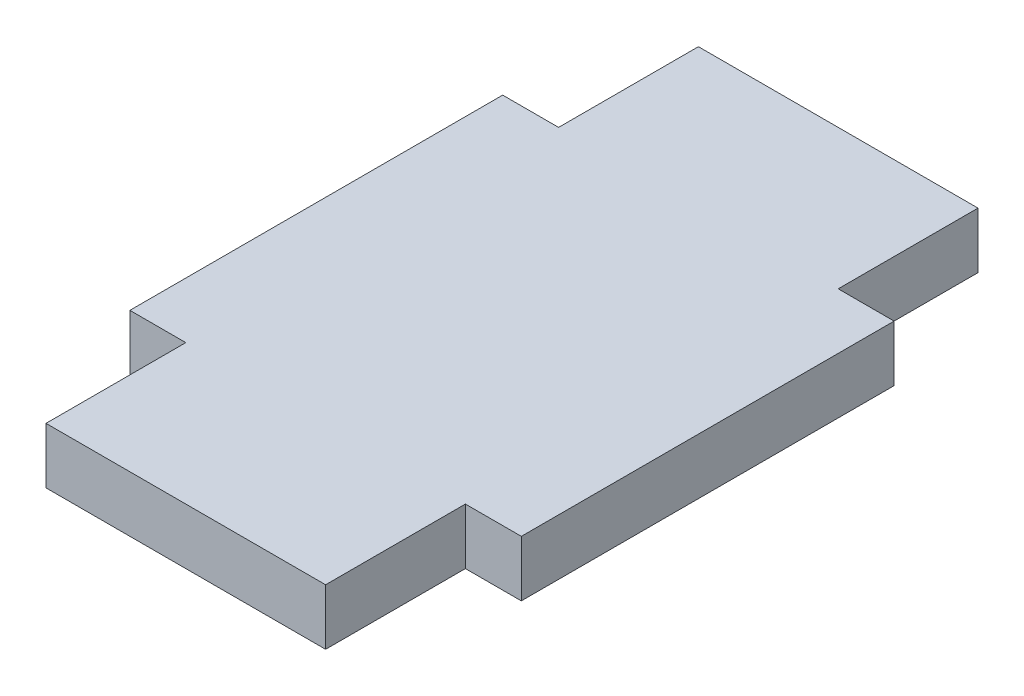
ISO-10303-21;
HEADER;
FILE_DESCRIPTION(('STEP AP214'),'2;1');
FILE_NAME('part.step','',(''),(''),'','','');
FILE_SCHEMA(('AUTOMOTIVE_DESIGN { 1 0 10303 214 1 1 1 1 }'));
ENDSEC;
DATA;
#1=APPLICATION_CONTEXT('core data for automotive mechanical design processes');
#2=APPLICATION_PROTOCOL_DEFINITION('international standard','automotive_design',2000,#1);
#3=PRODUCT_CONTEXT('',#1,'mechanical');
#4=PRODUCT('Part','Part','',(#3));
#5=PRODUCT_RELATED_PRODUCT_CATEGORY('part','',(#4));
#6=PRODUCT_DEFINITION_FORMATION('','',#4);
#7=PRODUCT_DEFINITION_CONTEXT('part definition',#1,'design');
#8=PRODUCT_DEFINITION('design','',#6,#7);
#9=PRODUCT_DEFINITION_SHAPE('','',#8);
#10=(LENGTH_UNIT() NAMED_UNIT(*) SI_UNIT(.MILLI.,.METRE.));
#11=(NAMED_UNIT(*) PLANE_ANGLE_UNIT() SI_UNIT($,.RADIAN.));
#12=(NAMED_UNIT(*) SI_UNIT($,.STERADIAN.) SOLID_ANGLE_UNIT());
#13=UNCERTAINTY_MEASURE_WITH_UNIT(LENGTH_MEASURE(1.E-05),#10,'distance_accuracy_value','');
#14=(GEOMETRIC_REPRESENTATION_CONTEXT(3) GLOBAL_UNCERTAINTY_ASSIGNED_CONTEXT((#13)) GLOBAL_UNIT_ASSIGNED_CONTEXT((#10,
#11,#12)) REPRESENTATION_CONTEXT('',''));
#15=CARTESIAN_POINT('',(0.,0.,0.));
#16=DIRECTION('',(0.,0.,1.));
#17=DIRECTION('',(1.,0.,0.));
#18=AXIS2_PLACEMENT_3D('',#15,#16,#17);
#19=CARTESIAN_POINT('',(-10.5,1.5,10.));
#20=DIRECTION('',(1.,0.,0.));
#21=DIRECTION('',(0.,0.,-1.));
#22=AXIS2_PLACEMENT_3D('',#19,#20,#21);
#23=PLANE('',#22);
#24=DIRECTION('',(0.,0.,1.));
#25=VECTOR('',#24,1.);
#26=CARTESIAN_POINT('',(-10.5,-1.5,10.));
#27=LINE('',#26,#25);
#28=CARTESIAN_POINT('',(-10.5,-1.5,-10.));
#29=VERTEX_POINT('',#28);
#30=CARTESIAN_POINT('',(-10.5,-1.5,10.));
#31=VERTEX_POINT('',#30);
#32=EDGE_CURVE('E159',#29,#31,#27,.T.);
#33=ORIENTED_EDGE('',*,*,#32,.T.);
#34=DIRECTION('',(0.,-1.,0.));
#35=VECTOR('',#34,1.);
#36=CARTESIAN_POINT('',(-10.5,1.5,10.));
#37=LINE('',#36,#35);
#38=CARTESIAN_POINT('',(-10.5,1.5,10.));
#39=VERTEX_POINT('',#38);
#40=EDGE_CURVE('E11',#39,#31,#37,.T.);
#41=ORIENTED_EDGE('',*,*,#40,.F.);
#42=DIRECTION('',(0.,0.,1.));
#43=VECTOR('',#42,1.);
#44=CARTESIAN_POINT('',(-10.5,1.5,10.));
#45=LINE('',#44,#43);
#46=CARTESIAN_POINT('',(-10.5,1.5,-10.));
#47=VERTEX_POINT('',#46);
#48=EDGE_CURVE('E181',#47,#39,#45,.T.);
#49=ORIENTED_EDGE('',*,*,#48,.F.);
#50=DIRECTION('',(0.,-1.,0.));
#51=VECTOR('',#50,1.);
#52=CARTESIAN_POINT('',(-10.5,1.5,-10.));
#53=LINE('',#52,#51);
#54=EDGE_CURVE('E155',#47,#29,#53,.T.);
#55=ORIENTED_EDGE('',*,*,#54,.T.);
#56=EDGE_LOOP('',(#33,#41,#49,#55));
#57=FACE_BOUND('',#56,.T.);
#58=ADVANCED_FACE('F39',(#57),#23,.F.);
#59=CARTESIAN_POINT('',(-7.5,1.5,10.));
#60=DIRECTION('',(0.,0.,-1.));
#61=DIRECTION('',(-1.,0.,0.));
#62=AXIS2_PLACEMENT_3D('',#59,#60,#61);
#63=PLANE('',#62);
#64=DIRECTION('',(1.,0.,0.));
#65=VECTOR('',#64,1.);
#66=CARTESIAN_POINT('',(-7.5,-1.5,10.));
#67=LINE('',#66,#65);
#68=CARTESIAN_POINT('',(-7.5,-1.5,10.));
#69=VERTEX_POINT('',#68);
#70=EDGE_CURVE('E162',#31,#69,#67,.T.);
#71=ORIENTED_EDGE('',*,*,#70,.T.);
#72=DIRECTION('',(0.,-1.,0.));
#73=VECTOR('',#72,1.);
#74=CARTESIAN_POINT('',(-7.5,1.5,10.));
#75=LINE('',#74,#73);
#76=CARTESIAN_POINT('',(-7.5,1.5,10.));
#77=VERTEX_POINT('',#76);
#78=EDGE_CURVE('E47',#77,#69,#75,.T.);
#79=ORIENTED_EDGE('',*,*,#78,.F.);
#80=DIRECTION('',(1.,0.,0.));
#81=VECTOR('',#80,1.);
#82=CARTESIAN_POINT('',(-7.5,1.5,10.));
#83=LINE('',#82,#81);
#84=EDGE_CURVE('E110',#39,#77,#83,.T.);
#85=ORIENTED_EDGE('',*,*,#84,.F.);
#86=ORIENTED_EDGE('',*,*,#40,.T.);
#87=EDGE_LOOP('',(#71,#79,#85,#86));
#88=FACE_BOUND('',#87,.T.);
#89=ADVANCED_FACE('F259',(#88),#63,.F.);
#90=CARTESIAN_POINT('',(-7.5,1.5,17.5));
#91=DIRECTION('',(1.,0.,0.));
#92=DIRECTION('',(0.,0.,-1.));
#93=AXIS2_PLACEMENT_3D('',#90,#91,#92);
#94=PLANE('',#93);
#95=DIRECTION('',(0.,0.,1.));
#96=VECTOR('',#95,1.);
#97=CARTESIAN_POINT('',(-7.5,-1.5,17.5));
#98=LINE('',#97,#96);
#99=CARTESIAN_POINT('',(-7.5,-1.5,17.5));
#100=VERTEX_POINT('',#99);
#101=EDGE_CURVE('E164',#69,#100,#98,.T.);
#102=ORIENTED_EDGE('',*,*,#101,.T.);
#103=DIRECTION('',(0.,-1.,0.));
#104=VECTOR('',#103,1.);
#105=CARTESIAN_POINT('',(-7.5,1.5,17.5));
#106=LINE('',#105,#104);
#107=CARTESIAN_POINT('',(-7.5,1.5,17.5));
#108=VERTEX_POINT('',#107);
#109=EDGE_CURVE('E200',#108,#100,#106,.T.);
#110=ORIENTED_EDGE('',*,*,#109,.F.);
#111=DIRECTION('',(0.,0.,1.));
#112=VECTOR('',#111,1.);
#113=CARTESIAN_POINT('',(-7.5,1.5,17.5));
#114=LINE('',#113,#112);
#115=EDGE_CURVE('E208',#77,#108,#114,.T.);
#116=ORIENTED_EDGE('',*,*,#115,.F.);
#117=ORIENTED_EDGE('',*,*,#78,.T.);
#118=EDGE_LOOP('',(#102,#110,#116,#117));
#119=FACE_BOUND('',#118,.T.);
#120=ADVANCED_FACE('F206',(#119),#94,.F.);
#121=CARTESIAN_POINT('',(7.5,1.5,17.5));
#122=DIRECTION('',(0.,0.,-1.));
#123=DIRECTION('',(-1.,0.,0.));
#124=AXIS2_PLACEMENT_3D('',#121,#122,#123);
#125=PLANE('',#124);
#126=DIRECTION('',(1.,0.,0.));
#127=VECTOR('',#126,1.);
#128=CARTESIAN_POINT('',(7.5,-1.5,17.5));
#129=LINE('',#128,#127);
#130=CARTESIAN_POINT('',(7.5,-1.5,17.5));
#131=VERTEX_POINT('',#130);
#132=EDGE_CURVE('E166',#100,#131,#129,.T.);
#133=ORIENTED_EDGE('',*,*,#132,.T.);
#134=DIRECTION('',(0.,-1.,0.));
#135=VECTOR('',#134,1.);
#136=CARTESIAN_POINT('',(7.5,1.5,17.5));
#137=LINE('',#136,#135);
#138=CARTESIAN_POINT('',(7.5,1.5,17.5));
#139=VERTEX_POINT('',#138);
#140=EDGE_CURVE('E197',#139,#131,#137,.T.);
#141=ORIENTED_EDGE('',*,*,#140,.F.);
#142=DIRECTION('',(1.,0.,0.));
#143=VECTOR('',#142,1.);
#144=CARTESIAN_POINT('',(7.5,1.5,17.5));
#145=LINE('',#144,#143);
#146=EDGE_CURVE('E226',#108,#139,#145,.T.);
#147=ORIENTED_EDGE('',*,*,#146,.F.);
#148=ORIENTED_EDGE('',*,*,#109,.T.);
#149=EDGE_LOOP('',(#133,#141,#147,#148));
#150=FACE_BOUND('',#149,.T.);
#151=ADVANCED_FACE('F217',(#150),#125,.F.);
#152=CARTESIAN_POINT('',(7.5,1.5,10.));
#153=DIRECTION('',(-1.,0.,0.));
#154=DIRECTION('',(0.,0.,1.));
#155=AXIS2_PLACEMENT_3D('',#152,#153,#154);
#156=PLANE('',#155);
#157=DIRECTION('',(0.,0.,-1.));
#158=VECTOR('',#157,1.);
#159=CARTESIAN_POINT('',(7.5,-1.5,10.));
#160=LINE('',#159,#158);
#161=CARTESIAN_POINT('',(7.5,-1.5,10.));
#162=VERTEX_POINT('',#161);
#163=EDGE_CURVE('E168',#131,#162,#160,.T.);
#164=ORIENTED_EDGE('',*,*,#163,.T.);
#165=DIRECTION('',(0.,-1.,0.));
#166=VECTOR('',#165,1.);
#167=CARTESIAN_POINT('',(7.5,1.5,10.));
#168=LINE('',#167,#166);
#169=CARTESIAN_POINT('',(7.5,1.5,10.));
#170=VERTEX_POINT('',#169);
#171=EDGE_CURVE('E194',#170,#162,#168,.T.);
#172=ORIENTED_EDGE('',*,*,#171,.F.);
#173=DIRECTION('',(0.,0.,-1.));
#174=VECTOR('',#173,1.);
#175=CARTESIAN_POINT('',(7.5,1.5,10.));
#176=LINE('',#175,#174);
#177=EDGE_CURVE('E223',#139,#170,#176,.T.);
#178=ORIENTED_EDGE('',*,*,#177,.F.);
#179=ORIENTED_EDGE('',*,*,#140,.T.);
#180=EDGE_LOOP('',(#164,#172,#178,#179));
#181=FACE_BOUND('',#180,.T.);
#182=ADVANCED_FACE('F221',(#181),#156,.F.);
#183=CARTESIAN_POINT('',(10.5,1.5,10.));
#184=DIRECTION('',(0.,0.,-1.));
#185=DIRECTION('',(-1.,0.,0.));
#186=AXIS2_PLACEMENT_3D('',#183,#184,#185);
#187=PLANE('',#186);
#188=DIRECTION('',(1.,0.,0.));
#189=VECTOR('',#188,1.);
#190=CARTESIAN_POINT('',(10.5,-1.5,10.));
#191=LINE('',#190,#189);
#192=CARTESIAN_POINT('',(10.5,-1.5,10.));
#193=VERTEX_POINT('',#192);
#194=EDGE_CURVE('E170',#162,#193,#191,.T.);
#195=ORIENTED_EDGE('',*,*,#194,.T.);
#196=DIRECTION('',(0.,-1.,0.));
#197=VECTOR('',#196,1.);
#198=CARTESIAN_POINT('',(10.5,1.5,10.));
#199=LINE('',#198,#197);
#200=CARTESIAN_POINT('',(10.5,1.5,10.));
#201=VERTEX_POINT('',#200);
#202=EDGE_CURVE('E191',#201,#193,#199,.T.);
#203=ORIENTED_EDGE('',*,*,#202,.F.);
#204=DIRECTION('',(1.,0.,0.));
#205=VECTOR('',#204,1.);
#206=CARTESIAN_POINT('',(10.5,1.5,10.));
#207=LINE('',#206,#205);
#208=EDGE_CURVE('E225',#170,#201,#207,.T.);
#209=ORIENTED_EDGE('',*,*,#208,.F.);
#210=ORIENTED_EDGE('',*,*,#171,.T.);
#211=EDGE_LOOP('',(#195,#203,#209,#210));
#212=FACE_BOUND('',#211,.T.);
#213=ADVANCED_FACE('F272',(#212),#187,.F.);
#214=CARTESIAN_POINT('',(10.5,1.5,-10.));
#215=DIRECTION('',(-1.,0.,0.));
#216=DIRECTION('',(0.,0.,1.));
#217=AXIS2_PLACEMENT_3D('',#214,#215,#216);
#218=PLANE('',#217);
#219=DIRECTION('',(0.,0.,-1.));
#220=VECTOR('',#219,1.);
#221=CARTESIAN_POINT('',(10.5,-1.5,-10.));
#222=LINE('',#221,#220);
#223=CARTESIAN_POINT('',(10.5,-1.5,-10.));
#224=VERTEX_POINT('',#223);
#225=EDGE_CURVE('E172',#193,#224,#222,.T.);
#226=ORIENTED_EDGE('',*,*,#225,.T.);
#227=DIRECTION('',(0.,-1.,0.));
#228=VECTOR('',#227,1.);
#229=CARTESIAN_POINT('',(10.5,1.5,-10.));
#230=LINE('',#229,#228);
#231=CARTESIAN_POINT('',(10.5,1.5,-10.));
#232=VERTEX_POINT('',#231);
#233=EDGE_CURVE('E188',#232,#224,#230,.T.);
#234=ORIENTED_EDGE('',*,*,#233,.F.);
#235=DIRECTION('',(0.,0.,-1.));
#236=VECTOR('',#235,1.);
#237=CARTESIAN_POINT('',(10.5,1.5,-10.));
#238=LINE('',#237,#236);
#239=EDGE_CURVE('E228',#201,#232,#238,.T.);
#240=ORIENTED_EDGE('',*,*,#239,.F.);
#241=ORIENTED_EDGE('',*,*,#202,.T.);
#242=EDGE_LOOP('',(#226,#234,#240,#241));
#243=FACE_BOUND('',#242,.T.);
#244=ADVANCED_FACE('F275',(#243),#218,.F.);
#245=CARTESIAN_POINT('',(7.5,1.5,-10.));
#246=DIRECTION('',(0.,0.,1.));
#247=DIRECTION('',(1.,0.,0.));
#248=AXIS2_PLACEMENT_3D('',#245,#246,#247);
#249=PLANE('',#248);
#250=DIRECTION('',(-1.,0.,0.));
#251=VECTOR('',#250,1.);
#252=CARTESIAN_POINT('',(7.5,-1.5,-10.));
#253=LINE('',#252,#251);
#254=CARTESIAN_POINT('',(7.5,-1.5,-10.));
#255=VERTEX_POINT('',#254);
#256=EDGE_CURVE('E174',#224,#255,#253,.T.);
#257=ORIENTED_EDGE('',*,*,#256,.T.);
#258=DIRECTION('',(0.,-1.,0.));
#259=VECTOR('',#258,1.);
#260=CARTESIAN_POINT('',(7.5,1.5,-10.));
#261=LINE('',#260,#259);
#262=CARTESIAN_POINT('',(7.5,1.5,-10.));
#263=VERTEX_POINT('',#262);
#264=EDGE_CURVE('E185',#263,#255,#261,.T.);
#265=ORIENTED_EDGE('',*,*,#264,.F.);
#266=DIRECTION('',(-1.,0.,0.));
#267=VECTOR('',#266,1.);
#268=CARTESIAN_POINT('',(7.5,1.5,-10.));
#269=LINE('',#268,#267);
#270=EDGE_CURVE('E234',#232,#263,#269,.T.);
#271=ORIENTED_EDGE('',*,*,#270,.F.);
#272=ORIENTED_EDGE('',*,*,#233,.T.);
#273=EDGE_LOOP('',(#257,#265,#271,#272));
#274=FACE_BOUND('',#273,.T.);
#275=ADVANCED_FACE('F240',(#274),#249,.F.);
#276=CARTESIAN_POINT('',(7.5,1.5,-17.5));
#277=DIRECTION('',(-1.,0.,0.));
#278=DIRECTION('',(0.,0.,1.));
#279=AXIS2_PLACEMENT_3D('',#276,#277,#278);
#280=PLANE('',#279);
#281=DIRECTION('',(0.,0.,-1.));
#282=VECTOR('',#281,1.);
#283=CARTESIAN_POINT('',(7.5,-1.5,-17.5));
#284=LINE('',#283,#282);
#285=CARTESIAN_POINT('',(7.5,-1.5,-17.5));
#286=VERTEX_POINT('',#285);
#287=EDGE_CURVE('E176',#255,#286,#284,.T.);
#288=ORIENTED_EDGE('',*,*,#287,.T.);
#289=DIRECTION('',(0.,-1.,0.));
#290=VECTOR('',#289,1.);
#291=CARTESIAN_POINT('',(7.5,1.5,-17.5));
#292=LINE('',#291,#290);
#293=CARTESIAN_POINT('',(7.5,1.5,-17.5));
#294=VERTEX_POINT('',#293);
#295=EDGE_CURVE('E150',#294,#286,#292,.T.);
#296=ORIENTED_EDGE('',*,*,#295,.F.);
#297=DIRECTION('',(0.,0.,-1.));
#298=VECTOR('',#297,1.);
#299=CARTESIAN_POINT('',(7.5,1.5,-17.5));
#300=LINE('',#299,#298);
#301=EDGE_CURVE('E141',#263,#294,#300,.T.);
#302=ORIENTED_EDGE('',*,*,#301,.F.);
#303=ORIENTED_EDGE('',*,*,#264,.T.);
#304=EDGE_LOOP('',(#288,#296,#302,#303));
#305=FACE_BOUND('',#304,.T.);
#306=ADVANCED_FACE('F244',(#305),#280,.F.);
#307=CARTESIAN_POINT('',(-7.5,1.5,-17.5));
#308=DIRECTION('',(0.,0.,1.));
#309=DIRECTION('',(1.,0.,0.));
#310=AXIS2_PLACEMENT_3D('',#307,#308,#309);
#311=PLANE('',#310);
#312=DIRECTION('',(-1.,0.,0.));
#313=VECTOR('',#312,1.);
#314=CARTESIAN_POINT('',(-7.5,-1.5,-17.5));
#315=LINE('',#314,#313);
#316=CARTESIAN_POINT('',(-7.5,-1.5,-17.5));
#317=VERTEX_POINT('',#316);
#318=EDGE_CURVE('E149',#286,#317,#315,.T.);
#319=ORIENTED_EDGE('',*,*,#318,.T.);
#320=DIRECTION('',(0.,-1.,0.));
#321=VECTOR('',#320,1.);
#322=CARTESIAN_POINT('',(-7.5,1.5,-17.5));
#323=LINE('',#322,#321);
#324=CARTESIAN_POINT('',(-7.5,1.5,-17.5));
#325=VERTEX_POINT('',#324);
#326=EDGE_CURVE('E146',#325,#317,#323,.T.);
#327=ORIENTED_EDGE('',*,*,#326,.F.);
#328=DIRECTION('',(-1.,0.,0.));
#329=VECTOR('',#328,1.);
#330=CARTESIAN_POINT('',(-7.5,1.5,-17.5));
#331=LINE('',#330,#329);
#332=EDGE_CURVE('E135',#294,#325,#331,.T.);
#333=ORIENTED_EDGE('',*,*,#332,.F.);
#334=ORIENTED_EDGE('',*,*,#295,.T.);
#335=EDGE_LOOP('',(#319,#327,#333,#334));
#336=FACE_BOUND('',#335,.T.);
#337=ADVANCED_FACE('F147',(#336),#311,.F.);
#338=CARTESIAN_POINT('',(-7.5,1.5,-10.));
#339=DIRECTION('',(1.,0.,0.));
#340=DIRECTION('',(0.,0.,-1.));
#341=AXIS2_PLACEMENT_3D('',#338,#339,#340);
#342=PLANE('',#341);
#343=DIRECTION('',(0.,0.,1.));
#344=VECTOR('',#343,1.);
#345=CARTESIAN_POINT('',(-7.5,-1.5,-10.));
#346=LINE('',#345,#344);
#347=CARTESIAN_POINT('',(-7.5,-1.5,-10.));
#348=VERTEX_POINT('',#347);
#349=EDGE_CURVE('E96',#317,#348,#346,.T.);
#350=ORIENTED_EDGE('',*,*,#349,.T.);
#351=DIRECTION('',(0.,-1.,0.));
#352=VECTOR('',#351,1.);
#353=CARTESIAN_POINT('',(-7.5,1.5,-10.));
#354=LINE('',#353,#352);
#355=CARTESIAN_POINT('',(-7.5,1.5,-10.));
#356=VERTEX_POINT('',#355);
#357=EDGE_CURVE('E151',#356,#348,#354,.T.);
#358=ORIENTED_EDGE('',*,*,#357,.F.);
#359=DIRECTION('',(0.,0.,1.));
#360=VECTOR('',#359,1.);
#361=CARTESIAN_POINT('',(-7.5,1.5,-10.));
#362=LINE('',#361,#360);
#363=EDGE_CURVE('E139',#325,#356,#362,.T.);
#364=ORIENTED_EDGE('',*,*,#363,.F.);
#365=ORIENTED_EDGE('',*,*,#326,.T.);
#366=EDGE_LOOP('',(#350,#358,#364,#365));
#367=FACE_BOUND('',#366,.T.);
#368=ADVANCED_FACE('F153',(#367),#342,.F.);
#369=CARTESIAN_POINT('',(-10.5,1.5,-10.));
#370=DIRECTION('',(0.,0.,1.));
#371=DIRECTION('',(1.,0.,0.));
#372=AXIS2_PLACEMENT_3D('',#369,#370,#371);
#373=PLANE('',#372);
#374=DIRECTION('',(-1.,0.,0.));
#375=VECTOR('',#374,1.);
#376=CARTESIAN_POINT('',(-10.5,-1.5,-10.));
#377=LINE('',#376,#375);
#378=EDGE_CURVE('E102',#348,#29,#377,.T.);
#379=ORIENTED_EDGE('',*,*,#378,.T.);
#380=ORIENTED_EDGE('',*,*,#54,.F.);
#381=DIRECTION('',(-1.,0.,0.));
#382=VECTOR('',#381,1.);
#383=CARTESIAN_POINT('',(-10.5,1.5,-10.));
#384=LINE('',#383,#382);
#385=EDGE_CURVE('E55',#356,#47,#384,.T.);
#386=ORIENTED_EDGE('',*,*,#385,.F.);
#387=ORIENTED_EDGE('',*,*,#357,.T.);
#388=EDGE_LOOP('',(#379,#380,#386,#387));
#389=FACE_BOUND('',#388,.T.);
#390=ADVANCED_FACE('F248',(#389),#373,.F.);
#391=CARTESIAN_POINT('',(0.,1.5,0.));
#392=DIRECTION('',(0.,-1.,0.));
#393=DIRECTION('',(0.,0.,-1.));
#394=AXIS2_PLACEMENT_3D('',#391,#392,#393);
#395=PLANE('',#394);
#396=ORIENTED_EDGE('',*,*,#48,.T.);
#397=ORIENTED_EDGE('',*,*,#84,.T.);
#398=ORIENTED_EDGE('',*,*,#115,.T.);
#399=ORIENTED_EDGE('',*,*,#146,.T.);
#400=ORIENTED_EDGE('',*,*,#177,.T.);
#401=ORIENTED_EDGE('',*,*,#208,.T.);
#402=ORIENTED_EDGE('',*,*,#239,.T.);
#403=ORIENTED_EDGE('',*,*,#270,.T.);
#404=ORIENTED_EDGE('',*,*,#301,.T.);
#405=ORIENTED_EDGE('',*,*,#332,.T.);
#406=ORIENTED_EDGE('',*,*,#363,.T.);
#407=ORIENTED_EDGE('',*,*,#385,.T.);
#408=EDGE_LOOP('',(#396,#397,#398,#399,#400,#401,#402,#403,#404,#405,#406,#407));
#409=FACE_BOUND('',#408,.T.);
#410=ADVANCED_FACE('F137',(#409),#395,.F.);
#411=CARTESIAN_POINT('',(0.,-1.5,0.));
#412=DIRECTION('',(0.,-1.,0.));
#413=DIRECTION('',(0.,0.,-1.));
#414=AXIS2_PLACEMENT_3D('',#411,#412,#413);
#415=PLANE('',#414);
#416=ORIENTED_EDGE('',*,*,#32,.F.);
#417=ORIENTED_EDGE('',*,*,#378,.F.);
#418=ORIENTED_EDGE('',*,*,#349,.F.);
#419=ORIENTED_EDGE('',*,*,#318,.F.);
#420=ORIENTED_EDGE('',*,*,#287,.F.);
#421=ORIENTED_EDGE('',*,*,#256,.F.);
#422=ORIENTED_EDGE('',*,*,#225,.F.);
#423=ORIENTED_EDGE('',*,*,#194,.F.);
#424=ORIENTED_EDGE('',*,*,#163,.F.);
#425=ORIENTED_EDGE('',*,*,#132,.F.);
#426=ORIENTED_EDGE('',*,*,#101,.F.);
#427=ORIENTED_EDGE('',*,*,#70,.F.);
#428=EDGE_LOOP('',(#416,#417,#418,#419,#420,#421,#422,#423,#424,#425,#426,#427));
#429=FACE_BOUND('',#428,.T.);
#430=ADVANCED_FACE('F212',(#429),#415,.T.);
#431=CLOSED_SHELL('',(#58,#89,#120,#151,#182,#213,#244,#275,#306,#337,#368,#390,#410,#430));
#432=MANIFOLD_SOLID_BREP('B2',#431);
#433=ADVANCED_BREP_SHAPE_REPRESENTATION('',(#18,#432),#14);
#434=SHAPE_DEFINITION_REPRESENTATION(#9,#433);
ENDSEC;
END-ISO-10303-21;
